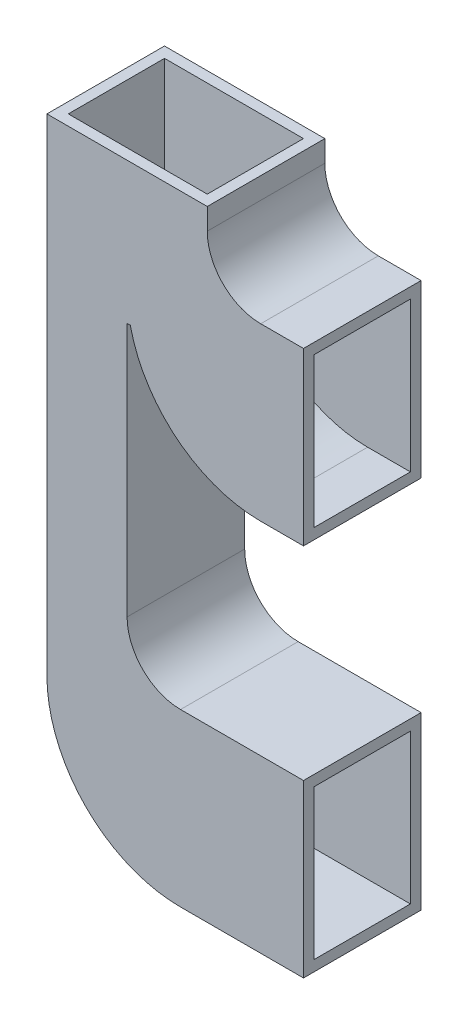
ISO-10303-21;
HEADER;
FILE_DESCRIPTION(('STEP AP214'),'2;1');
FILE_NAME('part.step','',(''),(''),'','','');
FILE_SCHEMA(('AUTOMOTIVE_DESIGN { 1 0 10303 214 1 1 1 1 }'));
ENDSEC;
DATA;
#1=APPLICATION_CONTEXT('core data for automotive mechanical design processes');
#2=APPLICATION_PROTOCOL_DEFINITION('international standard','automotive_design',2000,#1);
#3=PRODUCT_CONTEXT('',#1,'mechanical');
#4=PRODUCT('Part','Part','',(#3));
#5=PRODUCT_RELATED_PRODUCT_CATEGORY('part','',(#4));
#6=PRODUCT_DEFINITION_FORMATION('','',#4);
#7=PRODUCT_DEFINITION_CONTEXT('part definition',#1,'design');
#8=PRODUCT_DEFINITION('design','',#6,#7);
#9=PRODUCT_DEFINITION_SHAPE('','',#8);
#10=(LENGTH_UNIT() NAMED_UNIT(*) SI_UNIT(.MILLI.,.METRE.));
#11=(NAMED_UNIT(*) PLANE_ANGLE_UNIT() SI_UNIT($,.RADIAN.));
#12=(NAMED_UNIT(*) SI_UNIT($,.STERADIAN.) SOLID_ANGLE_UNIT());
#13=UNCERTAINTY_MEASURE_WITH_UNIT(LENGTH_MEASURE(1.E-05),#10,'distance_accuracy_value','');
#14=(GEOMETRIC_REPRESENTATION_CONTEXT(3) GLOBAL_UNCERTAINTY_ASSIGNED_CONTEXT((#13)) GLOBAL_UNIT_ASSIGNED_CONTEXT((#10,
#11,#12)) REPRESENTATION_CONTEXT('',''));
#15=CARTESIAN_POINT('',(0.,0.,0.));
#16=DIRECTION('',(0.,0.,1.));
#17=DIRECTION('',(1.,0.,0.));
#18=AXIS2_PLACEMENT_3D('',#15,#16,#17);
#19=CARTESIAN_POINT('',(15.,45.5,11.));
#20=DIRECTION('',(0.,-1.,0.));
#21=DIRECTION('',(0.,0.,-1.));
#22=AXIS2_PLACEMENT_3D('',#19,#20,#21);
#23=PLANE('',#22);
#24=DIRECTION('',(-1.,0.,0.));
#25=VECTOR('',#24,1.);
#26=CARTESIAN_POINT('',(15.,45.5,0.));
#27=LINE('',#26,#25);
#28=CARTESIAN_POINT('',(15.,45.5,0.));
#29=VERTEX_POINT('',#28);
#30=CARTESIAN_POINT('',(0.,45.5,0.));
#31=VERTEX_POINT('',#30);
#32=EDGE_CURVE('E333',#29,#31,#27,.T.);
#33=ORIENTED_EDGE('',*,*,#32,.T.);
#34=DIRECTION('',(0.,0.,-1.));
#35=VECTOR('',#34,1.);
#36=CARTESIAN_POINT('',(0.,45.5,11.));
#37=LINE('',#36,#35);
#38=CARTESIAN_POINT('',(0.,45.5,11.));
#39=VERTEX_POINT('',#38);
#40=EDGE_CURVE('E11',#39,#31,#37,.T.);
#41=ORIENTED_EDGE('',*,*,#40,.F.);
#42=DIRECTION('',(-1.,0.,0.));
#43=VECTOR('',#42,1.);
#44=CARTESIAN_POINT('',(15.,45.5,11.));
#45=LINE('',#44,#43);
#46=CARTESIAN_POINT('',(15.,45.5,11.));
#47=VERTEX_POINT('',#46);
#48=EDGE_CURVE('E351',#47,#39,#45,.T.);
#49=ORIENTED_EDGE('',*,*,#48,.F.);
#50=DIRECTION('',(0.,0.,-1.));
#51=VECTOR('',#50,1.);
#52=CARTESIAN_POINT('',(15.,45.5,11.));
#53=LINE('',#52,#51);
#54=EDGE_CURVE('E383',#47,#29,#53,.T.);
#55=ORIENTED_EDGE('',*,*,#54,.T.);
#56=EDGE_LOOP('',(#33,#41,#49,#55));
#57=FACE_BOUND('',#56,.T.);
#58=DIRECTION('',(-1.,0.,0.));
#59=VECTOR('',#58,1.);
#60=CARTESIAN_POINT('',(15.,45.5,1.));
#61=LINE('',#60,#59);
#62=CARTESIAN_POINT('',(14.,45.5,1.));
#63=VERTEX_POINT('',#62);
#64=CARTESIAN_POINT('',(1.,45.5,1.));
#65=VERTEX_POINT('',#64);
#66=EDGE_CURVE('E239',#63,#65,#61,.T.);
#67=ORIENTED_EDGE('',*,*,#66,.F.);
#68=DIRECTION('',(0.,0.,-1.));
#69=VECTOR('',#68,1.);
#70=CARTESIAN_POINT('',(14.,45.5,11.));
#71=LINE('',#70,#69);
#72=CARTESIAN_POINT('',(14.,45.5,10.));
#73=VERTEX_POINT('',#72);
#74=EDGE_CURVE('E288',#73,#63,#71,.T.);
#75=ORIENTED_EDGE('',*,*,#74,.F.);
#76=DIRECTION('',(-1.,0.,0.));
#77=VECTOR('',#76,1.);
#78=CARTESIAN_POINT('',(15.,45.5,10.));
#79=LINE('',#78,#77);
#80=CARTESIAN_POINT('',(1.,45.5,10.));
#81=VERTEX_POINT('',#80);
#82=EDGE_CURVE('E49',#73,#81,#79,.T.);
#83=ORIENTED_EDGE('',*,*,#82,.T.);
#84=DIRECTION('',(0.,0.,-1.));
#85=VECTOR('',#84,1.);
#86=CARTESIAN_POINT('',(1.,45.5,11.));
#87=LINE('',#86,#85);
#88=EDGE_CURVE('E250',#81,#65,#87,.T.);
#89=ORIENTED_EDGE('',*,*,#88,.T.);
#90=EDGE_LOOP('',(#67,#75,#83,#89));
#91=FACE_BOUND('',#90,.T.);
#92=ADVANCED_FACE('F35',(#57,#91),#23,.F.);
#93=CARTESIAN_POINT('',(24.,-12.5,11.));
#94=DIRECTION('',(-1.,0.,0.));
#95=DIRECTION('',(0.,0.,1.));
#96=AXIS2_PLACEMENT_3D('',#93,#94,#95);
#97=PLANE('',#96);
#98=DIRECTION('',(0.,1.,0.));
#99=VECTOR('',#98,1.);
#100=CARTESIAN_POINT('',(24.,-12.5,0.));
#101=LINE('',#100,#99);
#102=CARTESIAN_POINT('',(24.,-12.5,0.));
#103=VERTEX_POINT('',#102);
#104=CARTESIAN_POINT('',(24.,3.50000000000001,0.));
#105=VERTEX_POINT('',#104);
#106=EDGE_CURVE('E392',#103,#105,#101,.T.);
#107=ORIENTED_EDGE('',*,*,#106,.T.);
#108=DIRECTION('',(0.,0.,-1.));
#109=VECTOR('',#108,1.);
#110=CARTESIAN_POINT('',(24.,3.50000000000001,11.));
#111=LINE('',#110,#109);
#112=CARTESIAN_POINT('',(24.,3.50000000000001,11.));
#113=VERTEX_POINT('',#112);
#114=EDGE_CURVE('E442',#113,#105,#111,.T.);
#115=ORIENTED_EDGE('',*,*,#114,.F.);
#116=DIRECTION('',(0.,1.,0.));
#117=VECTOR('',#116,1.);
#118=CARTESIAN_POINT('',(24.,-12.5,11.));
#119=LINE('',#118,#117);
#120=CARTESIAN_POINT('',(24.,-12.5,11.));
#121=VERTEX_POINT('',#120);
#122=EDGE_CURVE('E361',#121,#113,#119,.T.);
#123=ORIENTED_EDGE('',*,*,#122,.F.);
#124=DIRECTION('',(0.,0.,-1.));
#125=VECTOR('',#124,1.);
#126=CARTESIAN_POINT('',(24.,-12.5,11.));
#127=LINE('',#126,#125);
#128=EDGE_CURVE('E445',#121,#103,#127,.T.);
#129=ORIENTED_EDGE('',*,*,#128,.T.);
#130=EDGE_LOOP('',(#107,#115,#123,#129));
#131=FACE_BOUND('',#130,.T.);
#132=DIRECTION('',(0.,1.,0.));
#133=VECTOR('',#132,1.);
#134=CARTESIAN_POINT('',(24.,-12.5,1.));
#135=LINE('',#134,#133);
#136=CARTESIAN_POINT('',(24.,-11.5,1.));
#137=VERTEX_POINT('',#136);
#138=CARTESIAN_POINT('',(24.,2.50000000000001,1.));
#139=VERTEX_POINT('',#138);
#140=EDGE_CURVE('E258',#137,#139,#135,.T.);
#141=ORIENTED_EDGE('',*,*,#140,.F.);
#142=DIRECTION('',(0.,0.,-1.));
#143=VECTOR('',#142,1.);
#144=CARTESIAN_POINT('',(24.,-11.5,11.));
#145=LINE('',#144,#143);
#146=CARTESIAN_POINT('',(24.,-11.5,10.));
#147=VERTEX_POINT('',#146);
#148=EDGE_CURVE('E263',#147,#137,#145,.T.);
#149=ORIENTED_EDGE('',*,*,#148,.F.);
#150=DIRECTION('',(0.,1.,0.));
#151=VECTOR('',#150,1.);
#152=CARTESIAN_POINT('',(24.,-12.5,10.));
#153=LINE('',#152,#151);
#154=CARTESIAN_POINT('',(24.,2.50000000000001,10.));
#155=VERTEX_POINT('',#154);
#156=EDGE_CURVE('E56',#147,#155,#153,.T.);
#157=ORIENTED_EDGE('',*,*,#156,.T.);
#158=DIRECTION('',(0.,0.,-1.));
#159=VECTOR('',#158,1.);
#160=CARTESIAN_POINT('',(24.,2.50000000000001,11.));
#161=LINE('',#160,#159);
#162=EDGE_CURVE('E295',#155,#139,#161,.T.);
#163=ORIENTED_EDGE('',*,*,#162,.T.);
#164=EDGE_LOOP('',(#141,#149,#157,#163));
#165=FACE_BOUND('',#164,.T.);
#166=ADVANCED_FACE('F470',(#131,#165),#97,.F.);
#167=CARTESIAN_POINT('',(24.,22.5,11.));
#168=DIRECTION('',(-1.,0.,0.));
#169=DIRECTION('',(0.,-1.,0.));
#170=AXIS2_PLACEMENT_3D('',#167,#168,#169);
#171=PLANE('',#170);
#172=DIRECTION('',(0.,1.,0.));
#173=VECTOR('',#172,1.);
#174=CARTESIAN_POINT('',(24.,22.5,0.));
#175=LINE('',#174,#173);
#176=CARTESIAN_POINT('',(24.,22.5,0.));
#177=VERTEX_POINT('',#176);
#178=CARTESIAN_POINT('',(24.,38.5,0.));
#179=VERTEX_POINT('',#178);
#180=EDGE_CURVE('E406',#177,#179,#175,.T.);
#181=ORIENTED_EDGE('',*,*,#180,.T.);
#182=DIRECTION('',(0.,0.,-1.));
#183=VECTOR('',#182,1.);
#184=CARTESIAN_POINT('',(24.,38.5,11.));
#185=LINE('',#184,#183);
#186=CARTESIAN_POINT('',(24.,38.5,11.));
#187=VERTEX_POINT('',#186);
#188=EDGE_CURVE('E421',#187,#179,#185,.T.);
#189=ORIENTED_EDGE('',*,*,#188,.F.);
#190=DIRECTION('',(0.,1.,0.));
#191=VECTOR('',#190,1.);
#192=CARTESIAN_POINT('',(24.,22.5,11.));
#193=LINE('',#192,#191);
#194=CARTESIAN_POINT('',(24.,22.5,11.));
#195=VERTEX_POINT('',#194);
#196=EDGE_CURVE('E375',#195,#187,#193,.T.);
#197=ORIENTED_EDGE('',*,*,#196,.F.);
#198=DIRECTION('',(0.,0.,-1.));
#199=VECTOR('',#198,1.);
#200=CARTESIAN_POINT('',(24.,22.5,11.));
#201=LINE('',#200,#199);
#202=EDGE_CURVE('E424',#195,#177,#201,.T.);
#203=ORIENTED_EDGE('',*,*,#202,.T.);
#204=EDGE_LOOP('',(#181,#189,#197,#203));
#205=FACE_BOUND('',#204,.T.);
#206=DIRECTION('',(0.,1.,0.));
#207=VECTOR('',#206,1.);
#208=CARTESIAN_POINT('',(24.,22.5,1.));
#209=LINE('',#208,#207);
#210=CARTESIAN_POINT('',(24.,23.5,1.));
#211=VERTEX_POINT('',#210);
#212=CARTESIAN_POINT('',(24.,37.5,1.));
#213=VERTEX_POINT('',#212);
#214=EDGE_CURVE('E318',#211,#213,#209,.T.);
#215=ORIENTED_EDGE('',*,*,#214,.F.);
#216=DIRECTION('',(0.,0.,-1.));
#217=VECTOR('',#216,1.);
#218=CARTESIAN_POINT('',(24.,23.5,11.));
#219=LINE('',#218,#217);
#220=CARTESIAN_POINT('',(24.,23.5,10.));
#221=VERTEX_POINT('',#220);
#222=EDGE_CURVE('E316',#221,#211,#219,.T.);
#223=ORIENTED_EDGE('',*,*,#222,.F.);
#224=DIRECTION('',(0.,1.,0.));
#225=VECTOR('',#224,1.);
#226=CARTESIAN_POINT('',(24.,22.5,10.));
#227=LINE('',#226,#225);
#228=CARTESIAN_POINT('',(24.,37.5,10.));
#229=VERTEX_POINT('',#228);
#230=EDGE_CURVE('E281',#221,#229,#227,.T.);
#231=ORIENTED_EDGE('',*,*,#230,.T.);
#232=DIRECTION('',(0.,0.,-1.));
#233=VECTOR('',#232,1.);
#234=CARTESIAN_POINT('',(24.,37.5,11.));
#235=LINE('',#234,#233);
#236=EDGE_CURVE('E328',#229,#213,#235,.T.);
#237=ORIENTED_EDGE('',*,*,#236,.T.);
#238=EDGE_LOOP('',(#215,#223,#231,#237));
#239=FACE_BOUND('',#238,.T.);
#240=ADVANCED_FACE('F502',(#205,#239),#171,.F.);
#241=CARTESIAN_POINT('',(0.,45.5,11.));
#242=DIRECTION('',(1.,0.,0.));
#243=DIRECTION('',(0.,1.,0.));
#244=AXIS2_PLACEMENT_3D('',#241,#242,#243);
#245=PLANE('',#244);
#246=DIRECTION('',(0.,-1.,0.));
#247=VECTOR('',#246,1.);
#248=CARTESIAN_POINT('',(0.,45.5,0.));
#249=LINE('',#248,#247);
#250=CARTESIAN_POINT('',(0.,0.,0.));
#251=VERTEX_POINT('',#250);
#252=EDGE_CURVE('E386',#31,#251,#249,.T.);
#253=ORIENTED_EDGE('',*,*,#252,.T.);
#254=DIRECTION('',(0.,0.,-1.));
#255=VECTOR('',#254,1.);
#256=CARTESIAN_POINT('',(0.,0.,11.));
#257=LINE('',#256,#255);
#258=CARTESIAN_POINT('',(0.,0.,11.));
#259=VERTEX_POINT('',#258);
#260=EDGE_CURVE('E42',#259,#251,#257,.T.);
#261=ORIENTED_EDGE('',*,*,#260,.F.);
#262=DIRECTION('',(0.,-1.,0.));
#263=VECTOR('',#262,1.);
#264=CARTESIAN_POINT('',(0.,45.5,11.));
#265=LINE('',#264,#263);
#266=EDGE_CURVE('E354',#39,#259,#265,.T.);
#267=ORIENTED_EDGE('',*,*,#266,.F.);
#268=ORIENTED_EDGE('',*,*,#40,.T.);
#269=EDGE_LOOP('',(#253,#261,#267,#268));
#270=FACE_BOUND('',#269,.T.);
#271=ADVANCED_FACE('F479',(#270),#245,.F.);
#272=CARTESIAN_POINT('',(12.5,0.,11.));
#273=DIRECTION('',(0.,0.,-1.));
#274=DIRECTION('',(-1.,0.,0.));
#275=AXIS2_PLACEMENT_3D('',#272,#273,#274);
#276=CYLINDRICAL_SURFACE('',#275,12.5);
#277=CARTESIAN_POINT('',(12.5,0.,0.));
#278=DIRECTION('',(0.,0.,1.));
#279=DIRECTION('',(1.,0.,0.));
#280=AXIS2_PLACEMENT_3D('',#277,#278,#279);
#281=CIRCLE('',#280,12.5);
#282=CARTESIAN_POINT('',(12.5,-12.5,0.));
#283=VERTEX_POINT('',#282);
#284=EDGE_CURVE('E388',#251,#283,#281,.T.);
#285=ORIENTED_EDGE('',*,*,#284,.T.);
#286=DIRECTION('',(0.,0.,-1.));
#287=VECTOR('',#286,1.);
#288=CARTESIAN_POINT('',(12.5,-12.5,11.));
#289=LINE('',#288,#287);
#290=CARTESIAN_POINT('',(12.5,-12.5,11.));
#291=VERTEX_POINT('',#290);
#292=EDGE_CURVE('E448',#291,#283,#289,.T.);
#293=ORIENTED_EDGE('',*,*,#292,.F.);
#294=CARTESIAN_POINT('',(12.5,0.,11.));
#295=DIRECTION('',(0.,0.,1.));
#296=DIRECTION('',(1.,0.,0.));
#297=AXIS2_PLACEMENT_3D('',#294,#295,#296);
#298=CIRCLE('',#297,12.5);
#299=EDGE_CURVE('E357',#259,#291,#298,.T.);
#300=ORIENTED_EDGE('',*,*,#299,.F.);
#301=ORIENTED_EDGE('',*,*,#260,.T.);
#302=EDGE_LOOP('',(#285,#293,#300,#301));
#303=FACE_BOUND('',#302,.T.);
#304=ADVANCED_FACE('F455',(#303),#276,.T.);
#305=CARTESIAN_POINT('',(12.5,-12.5,11.));
#306=DIRECTION('',(0.,1.,0.));
#307=DIRECTION('',(-1.,0.,0.));
#308=AXIS2_PLACEMENT_3D('',#305,#306,#307);
#309=PLANE('',#308);
#310=DIRECTION('',(1.,0.,0.));
#311=VECTOR('',#310,1.);
#312=CARTESIAN_POINT('',(12.5,-12.5,0.));
#313=LINE('',#312,#311);
#314=EDGE_CURVE('E390',#283,#103,#313,.T.);
#315=ORIENTED_EDGE('',*,*,#314,.T.);
#316=ORIENTED_EDGE('',*,*,#128,.F.);
#317=DIRECTION('',(1.,0.,0.));
#318=VECTOR('',#317,1.);
#319=CARTESIAN_POINT('',(12.5,-12.5,11.));
#320=LINE('',#319,#318);
#321=EDGE_CURVE('E359',#291,#121,#320,.T.);
#322=ORIENTED_EDGE('',*,*,#321,.F.);
#323=ORIENTED_EDGE('',*,*,#292,.T.);
#324=EDGE_LOOP('',(#315,#316,#322,#323));
#325=FACE_BOUND('',#324,.T.);
#326=ADVANCED_FACE('F466',(#325),#309,.F.);
#327=CARTESIAN_POINT('',(24.,3.50000000000001,11.));
#328=DIRECTION('',(0.,-1.,0.));
#329=DIRECTION('',(1.,0.,0.));
#330=AXIS2_PLACEMENT_3D('',#327,#328,#329);
#331=PLANE('',#330);
#332=DIRECTION('',(-1.,0.,0.));
#333=VECTOR('',#332,1.);
#334=CARTESIAN_POINT('',(24.,3.50000000000001,0.));
#335=LINE('',#334,#333);
#336=CARTESIAN_POINT('',(12.5,3.5,0.));
#337=VERTEX_POINT('',#336);
#338=EDGE_CURVE('E394',#105,#337,#335,.T.);
#339=ORIENTED_EDGE('',*,*,#338,.T.);
#340=DIRECTION('',(0.,0.,-1.));
#341=VECTOR('',#340,1.);
#342=CARTESIAN_POINT('',(12.5,3.5,11.));
#343=LINE('',#342,#341);
#344=CARTESIAN_POINT('',(12.5,3.5,11.));
#345=VERTEX_POINT('',#344);
#346=EDGE_CURVE('E439',#345,#337,#343,.T.);
#347=ORIENTED_EDGE('',*,*,#346,.F.);
#348=DIRECTION('',(-1.,0.,0.));
#349=VECTOR('',#348,1.);
#350=CARTESIAN_POINT('',(24.,3.50000000000001,11.));
#351=LINE('',#350,#349);
#352=EDGE_CURVE('E363',#113,#345,#351,.T.);
#353=ORIENTED_EDGE('',*,*,#352,.F.);
#354=ORIENTED_EDGE('',*,*,#114,.T.);
#355=EDGE_LOOP('',(#339,#347,#353,#354));
#356=FACE_BOUND('',#355,.T.);
#357=ADVANCED_FACE('F529',(#356),#331,.F.);
#358=CARTESIAN_POINT('',(12.5,8.5,11.));
#359=DIRECTION('',(0.,0.,-1.));
#360=DIRECTION('',(-1.,0.,0.));
#361=AXIS2_PLACEMENT_3D('',#358,#359,#360);
#362=CYLINDRICAL_SURFACE('',#361,5.);
#363=CARTESIAN_POINT('',(12.5,8.5,0.));
#364=DIRECTION('',(0.,0.,-1.));
#365=DIRECTION('',(-1.,0.,0.));
#366=AXIS2_PLACEMENT_3D('',#363,#364,#365);
#367=CIRCLE('',#366,5.);
#368=CARTESIAN_POINT('',(7.5,8.5,0.));
#369=VERTEX_POINT('',#368);
#370=EDGE_CURVE('E396',#337,#369,#367,.T.);
#371=ORIENTED_EDGE('',*,*,#370,.T.);
#372=DIRECTION('',(0.,0.,-1.));
#373=VECTOR('',#372,1.);
#374=CARTESIAN_POINT('',(7.5,8.5,11.));
#375=LINE('',#374,#373);
#376=CARTESIAN_POINT('',(7.5,8.5,11.));
#377=VERTEX_POINT('',#376);
#378=EDGE_CURVE('E436',#377,#369,#375,.T.);
#379=ORIENTED_EDGE('',*,*,#378,.F.);
#380=CARTESIAN_POINT('',(12.5,8.5,11.));
#381=DIRECTION('',(0.,0.,-1.));
#382=DIRECTION('',(-1.,0.,0.));
#383=AXIS2_PLACEMENT_3D('',#380,#381,#382);
#384=CIRCLE('',#383,5.);
#385=EDGE_CURVE('E365',#345,#377,#384,.T.);
#386=ORIENTED_EDGE('',*,*,#385,.F.);
#387=ORIENTED_EDGE('',*,*,#346,.T.);
#388=EDGE_LOOP('',(#371,#379,#386,#387));
#389=FACE_BOUND('',#388,.T.);
#390=ADVANCED_FACE('F527',(#389),#362,.F.);
#391=CARTESIAN_POINT('',(7.5,8.5,11.));
#392=DIRECTION('',(-1.,0.,0.));
#393=DIRECTION('',(0.,0.,1.));
#394=AXIS2_PLACEMENT_3D('',#391,#392,#393);
#395=PLANE('',#394);
#396=DIRECTION('',(0.,1.,0.));
#397=VECTOR('',#396,1.);
#398=CARTESIAN_POINT('',(7.5,8.5,0.));
#399=LINE('',#398,#397);
#400=CARTESIAN_POINT('',(7.5,32.2778684822368,0.));
#401=VERTEX_POINT('',#400);
#402=EDGE_CURVE('E398',#369,#401,#399,.T.);
#403=ORIENTED_EDGE('',*,*,#402,.T.);
#404=DIRECTION('',(0.,0.,-1.));
#405=VECTOR('',#404,1.);
#406=CARTESIAN_POINT('',(7.5,32.2778684822368,11.));
#407=LINE('',#406,#405);
#408=CARTESIAN_POINT('',(7.5,32.2778684822368,11.));
#409=VERTEX_POINT('',#408);
#410=EDGE_CURVE('E433',#409,#401,#407,.T.);
#411=ORIENTED_EDGE('',*,*,#410,.F.);
#412=DIRECTION('',(0.,1.,0.));
#413=VECTOR('',#412,1.);
#414=CARTESIAN_POINT('',(7.5,8.5,11.));
#415=LINE('',#414,#413);
#416=EDGE_CURVE('E367',#377,#409,#415,.T.);
#417=ORIENTED_EDGE('',*,*,#416,.F.);
#418=ORIENTED_EDGE('',*,*,#378,.T.);
#419=EDGE_LOOP('',(#403,#411,#417,#418));
#420=FACE_BOUND('',#419,.T.);
#421=ADVANCED_FACE('F523',(#420),#395,.F.);
#422=CARTESIAN_POINT('',(7.8,32.2778684822368,11.));
#423=DIRECTION('',(0.,1.,0.));
#424=DIRECTION('',(0.,0.,1.));
#425=AXIS2_PLACEMENT_3D('',#422,#423,#424);
#426=PLANE('',#425);
#427=DIRECTION('',(1.,0.,0.));
#428=VECTOR('',#427,1.);
#429=CARTESIAN_POINT('',(7.8,32.2778684822368,0.));
#430=LINE('',#429,#428);
#431=CARTESIAN_POINT('',(7.8,32.2778684822368,0.));
#432=VERTEX_POINT('',#431);
#433=EDGE_CURVE('E400',#401,#432,#430,.T.);
#434=ORIENTED_EDGE('',*,*,#433,.T.);
#435=DIRECTION('',(0.,0.,-1.));
#436=VECTOR('',#435,1.);
#437=CARTESIAN_POINT('',(7.8,32.2778684822368,11.));
#438=LINE('',#437,#436);
#439=CARTESIAN_POINT('',(7.8,32.2778684822368,11.));
#440=VERTEX_POINT('',#439);
#441=EDGE_CURVE('E430',#440,#432,#438,.T.);
#442=ORIENTED_EDGE('',*,*,#441,.F.);
#443=DIRECTION('',(1.,0.,0.));
#444=VECTOR('',#443,1.);
#445=CARTESIAN_POINT('',(7.8,32.2778684822368,11.));
#446=LINE('',#445,#444);
#447=EDGE_CURVE('E369',#409,#440,#446,.T.);
#448=ORIENTED_EDGE('',*,*,#447,.F.);
#449=ORIENTED_EDGE('',*,*,#410,.T.);
#450=EDGE_LOOP('',(#434,#442,#448,#449));
#451=FACE_BOUND('',#450,.T.);
#452=ADVANCED_FACE('F518',(#451),#426,.F.);
#453=CARTESIAN_POINT('',(20.,35.,11.));
#454=DIRECTION('',(0.,0.,-1.));
#455=DIRECTION('',(-1.,0.,0.));
#456=AXIS2_PLACEMENT_3D('',#453,#454,#455);
#457=CYLINDRICAL_SURFACE('',#456,12.5);
#458=CARTESIAN_POINT('',(20.,35.,0.));
#459=DIRECTION('',(0.,0.,1.));
#460=DIRECTION('',(1.,0.,0.));
#461=AXIS2_PLACEMENT_3D('',#458,#459,#460);
#462=CIRCLE('',#461,12.5);
#463=CARTESIAN_POINT('',(20.,22.5,0.));
#464=VERTEX_POINT('',#463);
#465=EDGE_CURVE('E402',#432,#464,#462,.T.);
#466=ORIENTED_EDGE('',*,*,#465,.T.);
#467=DIRECTION('',(0.,0.,-1.));
#468=VECTOR('',#467,1.);
#469=CARTESIAN_POINT('',(20.,22.5,11.));
#470=LINE('',#469,#468);
#471=CARTESIAN_POINT('',(20.,22.5,11.));
#472=VERTEX_POINT('',#471);
#473=EDGE_CURVE('E427',#472,#464,#470,.T.);
#474=ORIENTED_EDGE('',*,*,#473,.F.);
#475=CARTESIAN_POINT('',(20.,35.,11.));
#476=DIRECTION('',(0.,0.,1.));
#477=DIRECTION('',(1.,0.,0.));
#478=AXIS2_PLACEMENT_3D('',#475,#476,#477);
#479=CIRCLE('',#478,12.5);
#480=EDGE_CURVE('E371',#440,#472,#479,.T.);
#481=ORIENTED_EDGE('',*,*,#480,.F.);
#482=ORIENTED_EDGE('',*,*,#441,.T.);
#483=EDGE_LOOP('',(#466,#474,#481,#482));
#484=FACE_BOUND('',#483,.T.);
#485=ADVANCED_FACE('F512',(#484),#457,.T.);
#486=CARTESIAN_POINT('',(20.,22.5,11.));
#487=DIRECTION('',(0.,1.,0.));
#488=DIRECTION('',(0.,0.,1.));
#489=AXIS2_PLACEMENT_3D('',#486,#487,#488);
#490=PLANE('',#489);
#491=DIRECTION('',(1.,0.,0.));
#492=VECTOR('',#491,1.);
#493=CARTESIAN_POINT('',(20.,22.5,0.));
#494=LINE('',#493,#492);
#495=EDGE_CURVE('E404',#464,#177,#494,.T.);
#496=ORIENTED_EDGE('',*,*,#495,.T.);
#497=ORIENTED_EDGE('',*,*,#202,.F.);
#498=DIRECTION('',(1.,0.,0.));
#499=VECTOR('',#498,1.);
#500=CARTESIAN_POINT('',(20.,22.5,11.));
#501=LINE('',#500,#499);
#502=EDGE_CURVE('E373',#472,#195,#501,.T.);
#503=ORIENTED_EDGE('',*,*,#502,.F.);
#504=ORIENTED_EDGE('',*,*,#473,.T.);
#505=EDGE_LOOP('',(#496,#497,#503,#504));
#506=FACE_BOUND('',#505,.T.);
#507=ADVANCED_FACE('F508',(#506),#490,.F.);
#508=CARTESIAN_POINT('',(24.,38.5,11.));
#509=DIRECTION('',(0.,-1.,0.));
#510=DIRECTION('',(1.,0.,0.));
#511=AXIS2_PLACEMENT_3D('',#508,#509,#510);
#512=PLANE('',#511);
#513=DIRECTION('',(-1.,0.,0.));
#514=VECTOR('',#513,1.);
#515=CARTESIAN_POINT('',(24.,38.5,0.));
#516=LINE('',#515,#514);
#517=CARTESIAN_POINT('',(20.,38.5,0.));
#518=VERTEX_POINT('',#517);
#519=EDGE_CURVE('E408',#179,#518,#516,.T.);
#520=ORIENTED_EDGE('',*,*,#519,.T.);
#521=DIRECTION('',(0.,0.,-1.));
#522=VECTOR('',#521,1.);
#523=CARTESIAN_POINT('',(20.,38.5,11.));
#524=LINE('',#523,#522);
#525=CARTESIAN_POINT('',(20.,38.5,11.));
#526=VERTEX_POINT('',#525);
#527=EDGE_CURVE('E418',#526,#518,#524,.T.);
#528=ORIENTED_EDGE('',*,*,#527,.F.);
#529=DIRECTION('',(-1.,0.,0.));
#530=VECTOR('',#529,1.);
#531=CARTESIAN_POINT('',(24.,38.5,11.));
#532=LINE('',#531,#530);
#533=EDGE_CURVE('E377',#187,#526,#532,.T.);
#534=ORIENTED_EDGE('',*,*,#533,.F.);
#535=ORIENTED_EDGE('',*,*,#188,.T.);
#536=EDGE_LOOP('',(#520,#528,#534,#535));
#537=FACE_BOUND('',#536,.T.);
#538=ADVANCED_FACE('F496',(#537),#512,.F.);
#539=CARTESIAN_POINT('',(20.,43.5,11.));
#540=DIRECTION('',(0.,0.,-1.));
#541=DIRECTION('',(-1.,0.,0.));
#542=AXIS2_PLACEMENT_3D('',#539,#540,#541);
#543=CYLINDRICAL_SURFACE('',#542,4.99999999999999);
#544=CARTESIAN_POINT('',(20.,43.5,0.));
#545=DIRECTION('',(0.,0.,-1.));
#546=DIRECTION('',(-1.,0.,0.));
#547=AXIS2_PLACEMENT_3D('',#544,#545,#546);
#548=CIRCLE('',#547,4.99999999999999);
#549=CARTESIAN_POINT('',(15.,43.5,0.));
#550=VERTEX_POINT('',#549);
#551=EDGE_CURVE('E410',#518,#550,#548,.T.);
#552=ORIENTED_EDGE('',*,*,#551,.T.);
#553=DIRECTION('',(0.,0.,-1.));
#554=VECTOR('',#553,1.);
#555=CARTESIAN_POINT('',(15.,43.5,11.));
#556=LINE('',#555,#554);
#557=CARTESIAN_POINT('',(15.,43.5,11.));
#558=VERTEX_POINT('',#557);
#559=EDGE_CURVE('E415',#558,#550,#556,.T.);
#560=ORIENTED_EDGE('',*,*,#559,.F.);
#561=CARTESIAN_POINT('',(20.,43.5,11.));
#562=DIRECTION('',(0.,0.,-1.));
#563=DIRECTION('',(-1.,0.,0.));
#564=AXIS2_PLACEMENT_3D('',#561,#562,#563);
#565=CIRCLE('',#564,4.99999999999999);
#566=EDGE_CURVE('E379',#526,#558,#565,.T.);
#567=ORIENTED_EDGE('',*,*,#566,.F.);
#568=ORIENTED_EDGE('',*,*,#527,.T.);
#569=EDGE_LOOP('',(#552,#560,#567,#568));
#570=FACE_BOUND('',#569,.T.);
#571=ADVANCED_FACE('F492',(#570),#543,.F.);
#572=CARTESIAN_POINT('',(15.,43.5,11.));
#573=DIRECTION('',(-1.,0.,0.));
#574=DIRECTION('',(0.,0.,1.));
#575=AXIS2_PLACEMENT_3D('',#572,#573,#574);
#576=PLANE('',#575);
#577=DIRECTION('',(0.,1.,0.));
#578=VECTOR('',#577,1.);
#579=CARTESIAN_POINT('',(15.,43.5,0.));
#580=LINE('',#579,#578);
#581=EDGE_CURVE('E355',#550,#29,#580,.T.);
#582=ORIENTED_EDGE('',*,*,#581,.T.);
#583=ORIENTED_EDGE('',*,*,#54,.F.);
#584=DIRECTION('',(0.,1.,0.));
#585=VECTOR('',#584,1.);
#586=CARTESIAN_POINT('',(15.,43.5,11.));
#587=LINE('',#586,#585);
#588=EDGE_CURVE('E381',#558,#47,#587,.T.);
#589=ORIENTED_EDGE('',*,*,#588,.F.);
#590=ORIENTED_EDGE('',*,*,#559,.T.);
#591=EDGE_LOOP('',(#582,#583,#589,#590));
#592=FACE_BOUND('',#591,.T.);
#593=ADVANCED_FACE('F487',(#592),#576,.F.);
#594=CARTESIAN_POINT('',(12.5,0.,11.));
#595=DIRECTION('',(0.,0.,1.));
#596=DIRECTION('',(1.,0.,0.));
#597=AXIS2_PLACEMENT_3D('',#594,#595,#596);
#598=PLANE('',#597);
#599=ORIENTED_EDGE('',*,*,#48,.T.);
#600=ORIENTED_EDGE('',*,*,#266,.T.);
#601=ORIENTED_EDGE('',*,*,#299,.T.);
#602=ORIENTED_EDGE('',*,*,#321,.T.);
#603=ORIENTED_EDGE('',*,*,#122,.T.);
#604=ORIENTED_EDGE('',*,*,#352,.T.);
#605=ORIENTED_EDGE('',*,*,#385,.T.);
#606=ORIENTED_EDGE('',*,*,#416,.T.);
#607=ORIENTED_EDGE('',*,*,#447,.T.);
#608=ORIENTED_EDGE('',*,*,#480,.T.);
#609=ORIENTED_EDGE('',*,*,#502,.T.);
#610=ORIENTED_EDGE('',*,*,#196,.T.);
#611=ORIENTED_EDGE('',*,*,#533,.T.);
#612=ORIENTED_EDGE('',*,*,#566,.T.);
#613=ORIENTED_EDGE('',*,*,#588,.T.);
#614=EDGE_LOOP('',(#599,#600,#601,#602,#603,#604,#605,#606,#607,#608,#609,#610,#611,#612,#613));
#615=FACE_BOUND('',#614,.T.);
#616=ADVANCED_FACE('F475',(#615),#598,.T.);
#617=CARTESIAN_POINT('',(12.5,0.,0.));
#618=DIRECTION('',(0.,0.,1.));
#619=DIRECTION('',(1.,0.,0.));
#620=AXIS2_PLACEMENT_3D('',#617,#618,#619);
#621=PLANE('',#620);
#622=ORIENTED_EDGE('',*,*,#32,.F.);
#623=ORIENTED_EDGE('',*,*,#581,.F.);
#624=ORIENTED_EDGE('',*,*,#551,.F.);
#625=ORIENTED_EDGE('',*,*,#519,.F.);
#626=ORIENTED_EDGE('',*,*,#180,.F.);
#627=ORIENTED_EDGE('',*,*,#495,.F.);
#628=ORIENTED_EDGE('',*,*,#465,.F.);
#629=ORIENTED_EDGE('',*,*,#433,.F.);
#630=ORIENTED_EDGE('',*,*,#402,.F.);
#631=ORIENTED_EDGE('',*,*,#370,.F.);
#632=ORIENTED_EDGE('',*,*,#338,.F.);
#633=ORIENTED_EDGE('',*,*,#106,.F.);
#634=ORIENTED_EDGE('',*,*,#314,.F.);
#635=ORIENTED_EDGE('',*,*,#284,.F.);
#636=ORIENTED_EDGE('',*,*,#252,.F.);
#637=EDGE_LOOP('',(#622,#623,#624,#625,#626,#627,#628,#629,#630,#631,#632,#633,#634,#635,#636));
#638=FACE_BOUND('',#637,.T.);
#639=ADVANCED_FACE('F461',(#638),#621,.F.);
#640=CARTESIAN_POINT('',(1.,45.5,11.));
#641=DIRECTION('',(1.,0.,0.));
#642=DIRECTION('',(0.,1.,0.));
#643=AXIS2_PLACEMENT_3D('',#640,#641,#642);
#644=PLANE('',#643);
#645=DIRECTION('',(0.,-1.,0.));
#646=VECTOR('',#645,1.);
#647=CARTESIAN_POINT('',(1.,45.5,1.));
#648=LINE('',#647,#646);
#649=CARTESIAN_POINT('',(1.,0.,1.));
#650=VERTEX_POINT('',#649);
#651=EDGE_CURVE('E232',#65,#650,#648,.T.);
#652=ORIENTED_EDGE('',*,*,#651,.F.);
#653=ORIENTED_EDGE('',*,*,#88,.F.);
#654=DIRECTION('',(0.,-1.,0.));
#655=VECTOR('',#654,1.);
#656=CARTESIAN_POINT('',(1.,45.5,10.));
#657=LINE('',#656,#655);
#658=CARTESIAN_POINT('',(1.,0.,10.));
#659=VERTEX_POINT('',#658);
#660=EDGE_CURVE('E247',#81,#659,#657,.T.);
#661=ORIENTED_EDGE('',*,*,#660,.T.);
#662=DIRECTION('',(0.,0.,-1.));
#663=VECTOR('',#662,1.);
#664=CARTESIAN_POINT('',(1.,0.,11.));
#665=LINE('',#664,#663);
#666=EDGE_CURVE('E245',#659,#650,#665,.T.);
#667=ORIENTED_EDGE('',*,*,#666,.T.);
#668=EDGE_LOOP('',(#652,#653,#661,#667));
#669=FACE_BOUND('',#668,.T.);
#670=ADVANCED_FACE('F246',(#669),#644,.T.);
#671=CARTESIAN_POINT('',(12.5,0.,11.));
#672=DIRECTION('',(0.,0.,-1.));
#673=DIRECTION('',(-1.,0.,0.));
#674=AXIS2_PLACEMENT_3D('',#671,#672,#673);
#675=CYLINDRICAL_SURFACE('',#674,11.5);
#676=CARTESIAN_POINT('',(12.5,0.,1.));
#677=DIRECTION('',(0.,0.,1.));
#678=DIRECTION('',(1.,0.,0.));
#679=AXIS2_PLACEMENT_3D('',#676,#677,#678);
#680=CIRCLE('',#679,11.5);
#681=CARTESIAN_POINT('',(12.5,-11.5,1.));
#682=VERTEX_POINT('',#681);
#683=EDGE_CURVE('E236',#650,#682,#680,.T.);
#684=ORIENTED_EDGE('',*,*,#683,.F.);
#685=ORIENTED_EDGE('',*,*,#666,.F.);
#686=CARTESIAN_POINT('',(12.5,0.,10.));
#687=DIRECTION('',(0.,0.,1.));
#688=DIRECTION('',(1.,0.,0.));
#689=AXIS2_PLACEMENT_3D('',#686,#687,#688);
#690=CIRCLE('',#689,11.5);
#691=CARTESIAN_POINT('',(12.5,-11.5,10.));
#692=VERTEX_POINT('',#691);
#693=EDGE_CURVE('E264',#659,#692,#690,.T.);
#694=ORIENTED_EDGE('',*,*,#693,.T.);
#695=DIRECTION('',(0.,0.,1.));
#696=VECTOR('',#695,1.);
#697=CARTESIAN_POINT('',(12.5,-11.5,11.));
#698=LINE('',#697,#696);
#699=EDGE_CURVE('E251',#692,#682,#698,.F.);
#700=ORIENTED_EDGE('',*,*,#699,.T.);
#701=EDGE_LOOP('',(#684,#685,#694,#700));
#702=FACE_BOUND('',#701,.T.);
#703=ADVANCED_FACE('F253',(#702),#675,.F.);
#704=CARTESIAN_POINT('',(12.5,-11.5,11.));
#705=DIRECTION('',(0.,1.,0.));
#706=DIRECTION('',(-1.,0.,0.));
#707=AXIS2_PLACEMENT_3D('',#704,#705,#706);
#708=PLANE('',#707);
#709=DIRECTION('',(1.,0.,0.));
#710=VECTOR('',#709,1.);
#711=CARTESIAN_POINT('',(12.5,-11.5,1.));
#712=LINE('',#711,#710);
#713=EDGE_CURVE('E256',#682,#137,#712,.T.);
#714=ORIENTED_EDGE('',*,*,#713,.F.);
#715=ORIENTED_EDGE('',*,*,#699,.F.);
#716=DIRECTION('',(1.,0.,0.));
#717=VECTOR('',#716,1.);
#718=CARTESIAN_POINT('',(12.5,-11.5,10.));
#719=LINE('',#718,#717);
#720=EDGE_CURVE('E265',#692,#147,#719,.T.);
#721=ORIENTED_EDGE('',*,*,#720,.T.);
#722=ORIENTED_EDGE('',*,*,#148,.T.);
#723=EDGE_LOOP('',(#714,#715,#721,#722));
#724=FACE_BOUND('',#723,.T.);
#725=ADVANCED_FACE('F673',(#724),#708,.T.);
#726=CARTESIAN_POINT('',(24.,2.50000000000001,11.));
#727=DIRECTION('',(0.,-1.,0.));
#728=DIRECTION('',(1.,0.,0.));
#729=AXIS2_PLACEMENT_3D('',#726,#727,#728);
#730=PLANE('',#729);
#731=DIRECTION('',(-1.,0.,0.));
#732=VECTOR('',#731,1.);
#733=CARTESIAN_POINT('',(24.,2.50000000000001,1.));
#734=LINE('',#733,#732);
#735=CARTESIAN_POINT('',(12.5,2.5,1.));
#736=VERTEX_POINT('',#735);
#737=EDGE_CURVE('E289',#139,#736,#734,.T.);
#738=ORIENTED_EDGE('',*,*,#737,.F.);
#739=ORIENTED_EDGE('',*,*,#162,.F.);
#740=DIRECTION('',(-1.,0.,0.));
#741=VECTOR('',#740,1.);
#742=CARTESIAN_POINT('',(24.,2.50000000000001,10.));
#743=LINE('',#742,#741);
#744=CARTESIAN_POINT('',(12.5,2.5,10.));
#745=VERTEX_POINT('',#744);
#746=EDGE_CURVE('E268',#155,#745,#743,.T.);
#747=ORIENTED_EDGE('',*,*,#746,.T.);
#748=DIRECTION('',(0.,0.,-1.));
#749=VECTOR('',#748,1.);
#750=CARTESIAN_POINT('',(12.5,2.5,11.));
#751=LINE('',#750,#749);
#752=EDGE_CURVE('E292',#745,#736,#751,.T.);
#753=ORIENTED_EDGE('',*,*,#752,.T.);
#754=EDGE_LOOP('',(#738,#739,#747,#753));
#755=FACE_BOUND('',#754,.T.);
#756=ADVANCED_FACE('F682',(#755),#730,.T.);
#757=CARTESIAN_POINT('',(12.5,8.5,11.));
#758=DIRECTION('',(0.,0.,-1.));
#759=DIRECTION('',(-1.,0.,0.));
#760=AXIS2_PLACEMENT_3D('',#757,#758,#759);
#761=CYLINDRICAL_SURFACE('',#760,6.);
#762=CARTESIAN_POINT('',(12.5,8.5,1.));
#763=DIRECTION('',(0.,0.,1.));
#764=DIRECTION('',(1.,0.,0.));
#765=AXIS2_PLACEMENT_3D('',#762,#763,#764);
#766=CIRCLE('',#765,6.);
#767=CARTESIAN_POINT('',(6.5,8.5,1.));
#768=VERTEX_POINT('',#767);
#769=EDGE_CURVE('E291',#736,#768,#766,.F.);
#770=ORIENTED_EDGE('',*,*,#769,.F.);
#771=ORIENTED_EDGE('',*,*,#752,.F.);
#772=CARTESIAN_POINT('',(12.5,8.5,10.));
#773=DIRECTION('',(0.,0.,1.));
#774=DIRECTION('',(1.,0.,0.));
#775=AXIS2_PLACEMENT_3D('',#772,#773,#774);
#776=CIRCLE('',#775,6.);
#777=CARTESIAN_POINT('',(6.5,8.5,10.));
#778=VERTEX_POINT('',#777);
#779=EDGE_CURVE('E270',#745,#778,#776,.F.);
#780=ORIENTED_EDGE('',*,*,#779,.T.);
#781=DIRECTION('',(0.,0.,1.));
#782=VECTOR('',#781,1.);
#783=CARTESIAN_POINT('',(6.5,8.5,11.));
#784=LINE('',#783,#782);
#785=EDGE_CURVE('E296',#778,#768,#784,.F.);
#786=ORIENTED_EDGE('',*,*,#785,.T.);
#787=EDGE_LOOP('',(#770,#771,#780,#786));
#788=FACE_BOUND('',#787,.T.);
#789=ADVANCED_FACE('F692',(#788),#761,.T.);
#790=CARTESIAN_POINT('',(6.5,8.5,11.));
#791=DIRECTION('',(-1.,0.,0.));
#792=DIRECTION('',(0.,0.,1.));
#793=AXIS2_PLACEMENT_3D('',#790,#791,#792);
#794=PLANE('',#793);
#795=DIRECTION('',(0.,1.,0.));
#796=VECTOR('',#795,1.);
#797=CARTESIAN_POINT('',(6.5,8.5,1.));
#798=LINE('',#797,#796);
#799=CARTESIAN_POINT('',(6.5,33.2778684822368,1.));
#800=VERTEX_POINT('',#799);
#801=EDGE_CURVE('E298',#768,#800,#798,.T.);
#802=ORIENTED_EDGE('',*,*,#801,.F.);
#803=ORIENTED_EDGE('',*,*,#785,.F.);
#804=DIRECTION('',(0.,1.,0.));
#805=VECTOR('',#804,1.);
#806=CARTESIAN_POINT('',(6.5,8.5,10.));
#807=LINE('',#806,#805);
#808=CARTESIAN_POINT('',(6.5,33.2778684822368,10.));
#809=VERTEX_POINT('',#808);
#810=EDGE_CURVE('E272',#778,#809,#807,.T.);
#811=ORIENTED_EDGE('',*,*,#810,.T.);
#812=DIRECTION('',(0.,0.,-1.));
#813=VECTOR('',#812,1.);
#814=CARTESIAN_POINT('',(6.5,33.2778684822368,11.));
#815=LINE('',#814,#813);
#816=EDGE_CURVE('E301',#809,#800,#815,.T.);
#817=ORIENTED_EDGE('',*,*,#816,.T.);
#818=EDGE_LOOP('',(#802,#803,#811,#817));
#819=FACE_BOUND('',#818,.T.);
#820=ADVANCED_FACE('F702',(#819),#794,.T.);
#821=CARTESIAN_POINT('',(7.8,33.2778684822368,11.));
#822=DIRECTION('',(0.,1.,0.));
#823=DIRECTION('',(0.,0.,1.));
#824=AXIS2_PLACEMENT_3D('',#821,#822,#823);
#825=PLANE('',#824);
#826=DIRECTION('',(1.,0.,0.));
#827=VECTOR('',#826,1.);
#828=CARTESIAN_POINT('',(7.8,33.2778684822368,1.));
#829=LINE('',#828,#827);
#830=CARTESIAN_POINT('',(8.6296762123708,33.2778684822368,1.));
#831=VERTEX_POINT('',#830);
#832=EDGE_CURVE('E303',#800,#831,#829,.T.);
#833=ORIENTED_EDGE('',*,*,#832,.F.);
#834=ORIENTED_EDGE('',*,*,#816,.F.);
#835=DIRECTION('',(1.,0.,0.));
#836=VECTOR('',#835,1.);
#837=CARTESIAN_POINT('',(7.8,33.2778684822368,10.));
#838=LINE('',#837,#836);
#839=CARTESIAN_POINT('',(8.6296762123708,33.2778684822368,10.));
#840=VERTEX_POINT('',#839);
#841=EDGE_CURVE('E274',#809,#840,#838,.T.);
#842=ORIENTED_EDGE('',*,*,#841,.T.);
#843=DIRECTION('',(0.,0.,-1.));
#844=VECTOR('',#843,1.);
#845=CARTESIAN_POINT('',(8.6296762123708,33.2778684822368,10.));
#846=LINE('',#845,#844);
#847=EDGE_CURVE('E306',#840,#831,#846,.T.);
#848=ORIENTED_EDGE('',*,*,#847,.T.);
#849=EDGE_LOOP('',(#833,#834,#842,#848));
#850=FACE_BOUND('',#849,.T.);
#851=ADVANCED_FACE('F712',(#850),#825,.T.);
#852=CARTESIAN_POINT('',(20.,35.,11.));
#853=DIRECTION('',(0.,0.,-1.));
#854=DIRECTION('',(-1.,0.,0.));
#855=AXIS2_PLACEMENT_3D('',#852,#853,#854);
#856=CYLINDRICAL_SURFACE('',#855,11.5);
#857=CARTESIAN_POINT('',(20.,35.,1.));
#858=DIRECTION('',(0.,0.,1.));
#859=DIRECTION('',(1.,0.,0.));
#860=AXIS2_PLACEMENT_3D('',#857,#858,#859);
#861=CIRCLE('',#860,11.5);
#862=CARTESIAN_POINT('',(20.,23.5,1.));
#863=VERTEX_POINT('',#862);
#864=EDGE_CURVE('E308',#831,#863,#861,.T.);
#865=ORIENTED_EDGE('',*,*,#864,.F.);
#866=ORIENTED_EDGE('',*,*,#847,.F.);
#867=CARTESIAN_POINT('',(20.,35.,10.));
#868=DIRECTION('',(0.,0.,1.));
#869=DIRECTION('',(1.,0.,0.));
#870=AXIS2_PLACEMENT_3D('',#867,#868,#869);
#871=CIRCLE('',#870,11.5);
#872=CARTESIAN_POINT('',(20.,23.5,10.));
#873=VERTEX_POINT('',#872);
#874=EDGE_CURVE('E276',#840,#873,#871,.T.);
#875=ORIENTED_EDGE('',*,*,#874,.T.);
#876=DIRECTION('',(0.,0.,1.));
#877=VECTOR('',#876,1.);
#878=CARTESIAN_POINT('',(20.,23.5,11.));
#879=LINE('',#878,#877);
#880=EDGE_CURVE('E311',#873,#863,#879,.F.);
#881=ORIENTED_EDGE('',*,*,#880,.T.);
#882=EDGE_LOOP('',(#865,#866,#875,#881));
#883=FACE_BOUND('',#882,.T.);
#884=ADVANCED_FACE('F722',(#883),#856,.F.);
#885=CARTESIAN_POINT('',(20.,23.5,11.));
#886=DIRECTION('',(0.,1.,0.));
#887=DIRECTION('',(0.,0.,1.));
#888=AXIS2_PLACEMENT_3D('',#885,#886,#887);
#889=PLANE('',#888);
#890=DIRECTION('',(1.,0.,0.));
#891=VECTOR('',#890,1.);
#892=CARTESIAN_POINT('',(20.,23.5,1.));
#893=LINE('',#892,#891);
#894=EDGE_CURVE('E313',#863,#211,#893,.T.);
#895=ORIENTED_EDGE('',*,*,#894,.F.);
#896=ORIENTED_EDGE('',*,*,#880,.F.);
#897=DIRECTION('',(1.,0.,0.));
#898=VECTOR('',#897,1.);
#899=CARTESIAN_POINT('',(20.,23.5,10.));
#900=LINE('',#899,#898);
#901=EDGE_CURVE('E278',#873,#221,#900,.T.);
#902=ORIENTED_EDGE('',*,*,#901,.T.);
#903=ORIENTED_EDGE('',*,*,#222,.T.);
#904=EDGE_LOOP('',(#895,#896,#902,#903));
#905=FACE_BOUND('',#904,.T.);
#906=ADVANCED_FACE('F732',(#905),#889,.T.);
#907=CARTESIAN_POINT('',(24.,37.5,11.));
#908=DIRECTION('',(0.,-1.,0.));
#909=DIRECTION('',(1.,0.,0.));
#910=AXIS2_PLACEMENT_3D('',#907,#908,#909);
#911=PLANE('',#910);
#912=DIRECTION('',(-1.,0.,0.));
#913=VECTOR('',#912,1.);
#914=CARTESIAN_POINT('',(24.,37.5,1.));
#915=LINE('',#914,#913);
#916=CARTESIAN_POINT('',(20.,37.5,1.));
#917=VERTEX_POINT('',#916);
#918=EDGE_CURVE('E323',#213,#917,#915,.T.);
#919=ORIENTED_EDGE('',*,*,#918,.F.);
#920=ORIENTED_EDGE('',*,*,#236,.F.);
#921=DIRECTION('',(-1.,0.,0.));
#922=VECTOR('',#921,1.);
#923=CARTESIAN_POINT('',(24.,37.5,10.));
#924=LINE('',#923,#922);
#925=CARTESIAN_POINT('',(20.,37.5,10.));
#926=VERTEX_POINT('',#925);
#927=EDGE_CURVE('E282',#229,#926,#924,.T.);
#928=ORIENTED_EDGE('',*,*,#927,.T.);
#929=DIRECTION('',(0.,0.,-1.));
#930=VECTOR('',#929,1.);
#931=CARTESIAN_POINT('',(20.,37.5,11.));
#932=LINE('',#931,#930);
#933=EDGE_CURVE('E325',#926,#917,#932,.T.);
#934=ORIENTED_EDGE('',*,*,#933,.T.);
#935=EDGE_LOOP('',(#919,#920,#928,#934));
#936=FACE_BOUND('',#935,.T.);
#937=ADVANCED_FACE('F742',(#936),#911,.T.);
#938=CARTESIAN_POINT('',(20.,43.5,11.));
#939=DIRECTION('',(0.,0.,-1.));
#940=DIRECTION('',(-1.,0.,0.));
#941=AXIS2_PLACEMENT_3D('',#938,#939,#940);
#942=CYLINDRICAL_SURFACE('',#941,5.99999999999999);
#943=CARTESIAN_POINT('',(20.,43.5,1.));
#944=DIRECTION('',(0.,0.,1.));
#945=DIRECTION('',(1.,0.,0.));
#946=AXIS2_PLACEMENT_3D('',#943,#944,#945);
#947=CIRCLE('',#946,5.99999999999999);
#948=CARTESIAN_POINT('',(14.,43.5,1.));
#949=VERTEX_POINT('',#948);
#950=EDGE_CURVE('E321',#917,#949,#947,.F.);
#951=ORIENTED_EDGE('',*,*,#950,.F.);
#952=ORIENTED_EDGE('',*,*,#933,.F.);
#953=CARTESIAN_POINT('',(20.,43.5,10.));
#954=DIRECTION('',(0.,0.,1.));
#955=DIRECTION('',(1.,0.,0.));
#956=AXIS2_PLACEMENT_3D('',#953,#954,#955);
#957=CIRCLE('',#956,5.99999999999999);
#958=CARTESIAN_POINT('',(14.,43.5,10.));
#959=VERTEX_POINT('',#958);
#960=EDGE_CURVE('E284',#926,#959,#957,.F.);
#961=ORIENTED_EDGE('',*,*,#960,.T.);
#962=DIRECTION('',(0.,0.,1.));
#963=VECTOR('',#962,1.);
#964=CARTESIAN_POINT('',(14.,43.5,11.));
#965=LINE('',#964,#963);
#966=EDGE_CURVE('E329',#959,#949,#965,.F.);
#967=ORIENTED_EDGE('',*,*,#966,.T.);
#968=EDGE_LOOP('',(#951,#952,#961,#967));
#969=FACE_BOUND('',#968,.T.);
#970=ADVANCED_FACE('F752',(#969),#942,.T.);
#971=CARTESIAN_POINT('',(14.,43.5,11.));
#972=DIRECTION('',(-1.,0.,0.));
#973=DIRECTION('',(0.,0.,1.));
#974=AXIS2_PLACEMENT_3D('',#971,#972,#973);
#975=PLANE('',#974);
#976=DIRECTION('',(0.,1.,0.));
#977=VECTOR('',#976,1.);
#978=CARTESIAN_POINT('',(14.,43.5,1.));
#979=LINE('',#978,#977);
#980=EDGE_CURVE('E319',#949,#63,#979,.T.);
#981=ORIENTED_EDGE('',*,*,#980,.F.);
#982=ORIENTED_EDGE('',*,*,#966,.F.);
#983=DIRECTION('',(0.,1.,0.));
#984=VECTOR('',#983,1.);
#985=CARTESIAN_POINT('',(14.,43.5,10.));
#986=LINE('',#985,#984);
#987=EDGE_CURVE('E286',#959,#73,#986,.T.);
#988=ORIENTED_EDGE('',*,*,#987,.T.);
#989=ORIENTED_EDGE('',*,*,#74,.T.);
#990=EDGE_LOOP('',(#981,#982,#988,#989));
#991=FACE_BOUND('',#990,.T.);
#992=ADVANCED_FACE('F762',(#991),#975,.T.);
#993=CARTESIAN_POINT('',(12.5,0.,10.));
#994=DIRECTION('',(0.,0.,1.));
#995=DIRECTION('',(1.,0.,0.));
#996=AXIS2_PLACEMENT_3D('',#993,#994,#995);
#997=PLANE('',#996);
#998=ORIENTED_EDGE('',*,*,#82,.F.);
#999=ORIENTED_EDGE('',*,*,#987,.F.);
#1000=ORIENTED_EDGE('',*,*,#960,.F.);
#1001=ORIENTED_EDGE('',*,*,#927,.F.);
#1002=ORIENTED_EDGE('',*,*,#230,.F.);
#1003=ORIENTED_EDGE('',*,*,#901,.F.);
#1004=ORIENTED_EDGE('',*,*,#874,.F.);
#1005=ORIENTED_EDGE('',*,*,#841,.F.);
#1006=ORIENTED_EDGE('',*,*,#810,.F.);
#1007=ORIENTED_EDGE('',*,*,#779,.F.);
#1008=ORIENTED_EDGE('',*,*,#746,.F.);
#1009=ORIENTED_EDGE('',*,*,#156,.F.);
#1010=ORIENTED_EDGE('',*,*,#720,.F.);
#1011=ORIENTED_EDGE('',*,*,#693,.F.);
#1012=ORIENTED_EDGE('',*,*,#660,.F.);
#1013=EDGE_LOOP('',(#998,#999,#1000,#1001,#1002,#1003,#1004,#1005,#1006,#1007,#1008,#1009,#1010,
#1011,#1012));
#1014=FACE_BOUND('',#1013,.T.);
#1015=ADVANCED_FACE('F772',(#1014),#997,.F.);
#1016=CARTESIAN_POINT('',(12.5,0.,1.));
#1017=DIRECTION('',(0.,0.,1.));
#1018=DIRECTION('',(1.,0.,0.));
#1019=AXIS2_PLACEMENT_3D('',#1016,#1017,#1018);
#1020=PLANE('',#1019);
#1021=ORIENTED_EDGE('',*,*,#66,.T.);
#1022=ORIENTED_EDGE('',*,*,#651,.T.);
#1023=ORIENTED_EDGE('',*,*,#683,.T.);
#1024=ORIENTED_EDGE('',*,*,#713,.T.);
#1025=ORIENTED_EDGE('',*,*,#140,.T.);
#1026=ORIENTED_EDGE('',*,*,#737,.T.);
#1027=ORIENTED_EDGE('',*,*,#769,.T.);
#1028=ORIENTED_EDGE('',*,*,#801,.T.);
#1029=ORIENTED_EDGE('',*,*,#832,.T.);
#1030=ORIENTED_EDGE('',*,*,#864,.T.);
#1031=ORIENTED_EDGE('',*,*,#894,.T.);
#1032=ORIENTED_EDGE('',*,*,#214,.T.);
#1033=ORIENTED_EDGE('',*,*,#918,.T.);
#1034=ORIENTED_EDGE('',*,*,#950,.T.);
#1035=ORIENTED_EDGE('',*,*,#980,.T.);
#1036=EDGE_LOOP('',(#1021,#1022,#1023,#1024,#1025,#1026,#1027,#1028,#1029,#1030,#1031,#1032,
#1033,#1034,#1035));
#1037=FACE_BOUND('',#1036,.T.);
#1038=ADVANCED_FACE('F234',(#1037),#1020,.T.);
#1039=CLOSED_SHELL('',(#92,#166,#240,#271,#304,#326,#357,#390,#421,#452,#485,#507,#538,#571,
#593,#616,#639,#670,#703,#725,#756,#789,#820,#851,#884,#906,#937,#970,#992,#1015,#1038));
#1040=MANIFOLD_SOLID_BREP('B2',#1039);
#1041=ADVANCED_BREP_SHAPE_REPRESENTATION('',(#18,#1040),#14);
#1042=SHAPE_DEFINITION_REPRESENTATION(#9,#1041);
ENDSEC;
END-ISO-10303-21;
